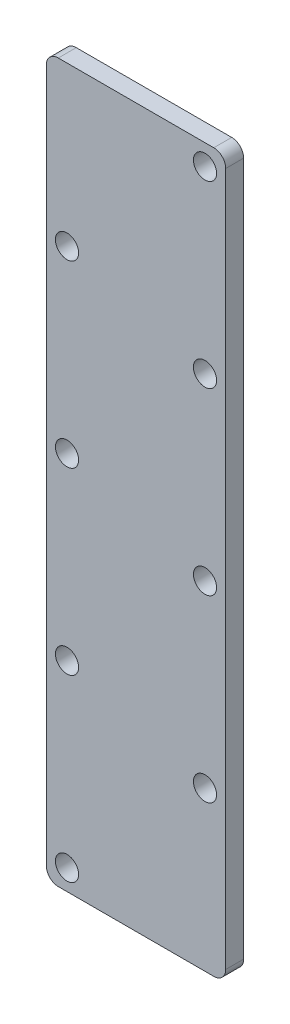
ISO-10303-21;
HEADER;
FILE_DESCRIPTION(('STEP AP214'),'2;1');
FILE_NAME('part.step','',(''),(''),'','','');
FILE_SCHEMA(('AUTOMOTIVE_DESIGN { 1 0 10303 214 1 1 1 1 }'));
ENDSEC;
DATA;
#1=APPLICATION_CONTEXT('core data for automotive mechanical design processes');
#2=APPLICATION_PROTOCOL_DEFINITION('international standard','automotive_design',2000,#1);
#3=PRODUCT_CONTEXT('',#1,'mechanical');
#4=PRODUCT('Part','Part','',(#3));
#5=PRODUCT_RELATED_PRODUCT_CATEGORY('part','',(#4));
#6=PRODUCT_DEFINITION_FORMATION('','',#4);
#7=PRODUCT_DEFINITION_CONTEXT('part definition',#1,'design');
#8=PRODUCT_DEFINITION('design','',#6,#7);
#9=PRODUCT_DEFINITION_SHAPE('','',#8);
#10=(LENGTH_UNIT() NAMED_UNIT(*) SI_UNIT(.MILLI.,.METRE.));
#11=(NAMED_UNIT(*) PLANE_ANGLE_UNIT() SI_UNIT($,.RADIAN.));
#12=(NAMED_UNIT(*) SI_UNIT($,.STERADIAN.) SOLID_ANGLE_UNIT());
#13=UNCERTAINTY_MEASURE_WITH_UNIT(LENGTH_MEASURE(1.E-05),#10,'distance_accuracy_value','');
#14=(GEOMETRIC_REPRESENTATION_CONTEXT(3) GLOBAL_UNCERTAINTY_ASSIGNED_CONTEXT((#13)) GLOBAL_UNIT_ASSIGNED_CONTEXT((#10,
#11,#12)) REPRESENTATION_CONTEXT('',''));
#15=CARTESIAN_POINT('',(0.,0.,0.));
#16=DIRECTION('',(0.,0.,1.));
#17=DIRECTION('',(1.,0.,0.));
#18=AXIS2_PLACEMENT_3D('',#15,#16,#17);
#19=CARTESIAN_POINT('',(2.,2.,3.));
#20=DIRECTION('',(0.,0.,-1.));
#21=DIRECTION('',(-1.,0.,0.));
#22=AXIS2_PLACEMENT_3D('',#19,#20,#21);
#23=CYLINDRICAL_SURFACE('',#22,2.);
#24=CARTESIAN_POINT('',(2.,2.,0.));
#25=DIRECTION('',(0.,0.,1.));
#26=DIRECTION('',(-1.,0.,0.));
#27=AXIS2_PLACEMENT_3D('',#24,#25,#26);
#28=CIRCLE('',#27,2.);
#29=CARTESIAN_POINT('',(0.,2.00000000000001,0.));
#30=VERTEX_POINT('',#29);
#31=CARTESIAN_POINT('',(2.00000000000001,0.,0.));
#32=VERTEX_POINT('',#31);
#33=EDGE_CURVE('E136',#30,#32,#28,.T.);
#34=ORIENTED_EDGE('',*,*,#33,.T.);
#35=DIRECTION('',(0.,0.,-1.));
#36=VECTOR('',#35,1.);
#37=CARTESIAN_POINT('',(2.00000000000001,0.,3.));
#38=LINE('',#37,#36);
#39=CARTESIAN_POINT('',(2.00000000000001,0.,3.));
#40=VERTEX_POINT('',#39);
#41=EDGE_CURVE('E11',#40,#32,#38,.T.);
#42=ORIENTED_EDGE('',*,*,#41,.F.);
#43=CARTESIAN_POINT('',(2.,2.,3.));
#44=DIRECTION('',(0.,0.,1.));
#45=DIRECTION('',(-1.,0.,0.));
#46=AXIS2_PLACEMENT_3D('',#43,#44,#45);
#47=CIRCLE('',#46,2.);
#48=CARTESIAN_POINT('',(0.,2.00000000000001,3.));
#49=VERTEX_POINT('',#48);
#50=EDGE_CURVE('E151',#49,#40,#47,.T.);
#51=ORIENTED_EDGE('',*,*,#50,.F.);
#52=DIRECTION('',(0.,0.,-1.));
#53=VECTOR('',#52,1.);
#54=CARTESIAN_POINT('',(0.,2.00000000000001,3.));
#55=LINE('',#54,#53);
#56=EDGE_CURVE('E132',#49,#30,#55,.T.);
#57=ORIENTED_EDGE('',*,*,#56,.T.);
#58=EDGE_LOOP('',(#34,#42,#51,#57));
#59=FACE_BOUND('',#58,.T.);
#60=ADVANCED_FACE('F38',(#59),#23,.T.);
#61=CARTESIAN_POINT('',(2.00000000000001,0.,3.));
#62=DIRECTION('',(0.,1.,0.));
#63=DIRECTION('',(0.,0.,1.));
#64=AXIS2_PLACEMENT_3D('',#61,#62,#63);
#65=PLANE('',#64);
#66=DIRECTION('',(1.,0.,0.));
#67=VECTOR('',#66,1.);
#68=CARTESIAN_POINT('',(2.00000000000001,0.,0.));
#69=LINE('',#68,#67);
#70=CARTESIAN_POINT('',(28.,0.,0.));
#71=VERTEX_POINT('',#70);
#72=EDGE_CURVE('E139',#32,#71,#69,.T.);
#73=ORIENTED_EDGE('',*,*,#72,.T.);
#74=DIRECTION('',(0.,0.,-1.));
#75=VECTOR('',#74,1.);
#76=CARTESIAN_POINT('',(28.,0.,3.));
#77=LINE('',#76,#75);
#78=CARTESIAN_POINT('',(28.,0.,3.));
#79=VERTEX_POINT('',#78);
#80=EDGE_CURVE('E47',#79,#71,#77,.T.);
#81=ORIENTED_EDGE('',*,*,#80,.F.);
#82=DIRECTION('',(1.,0.,0.));
#83=VECTOR('',#82,1.);
#84=CARTESIAN_POINT('',(2.00000000000001,0.,3.));
#85=LINE('',#84,#83);
#86=EDGE_CURVE('E99',#40,#79,#85,.T.);
#87=ORIENTED_EDGE('',*,*,#86,.F.);
#88=ORIENTED_EDGE('',*,*,#41,.T.);
#89=EDGE_LOOP('',(#73,#81,#87,#88));
#90=FACE_BOUND('',#89,.T.);
#91=ADVANCED_FACE('F236',(#90),#65,.F.);
#92=CARTESIAN_POINT('',(28.,2.,3.));
#93=DIRECTION('',(0.,0.,-1.));
#94=DIRECTION('',(-1.,0.,0.));
#95=AXIS2_PLACEMENT_3D('',#92,#93,#94);
#96=CYLINDRICAL_SURFACE('',#95,2.);
#97=CARTESIAN_POINT('',(28.,2.,0.));
#98=DIRECTION('',(0.,0.,1.));
#99=DIRECTION('',(1.,0.,0.));
#100=AXIS2_PLACEMENT_3D('',#97,#98,#99);
#101=CIRCLE('',#100,2.);
#102=CARTESIAN_POINT('',(30.,2.,0.));
#103=VERTEX_POINT('',#102);
#104=EDGE_CURVE('E142',#71,#103,#101,.T.);
#105=ORIENTED_EDGE('',*,*,#104,.T.);
#106=DIRECTION('',(0.,0.,-1.));
#107=VECTOR('',#106,1.);
#108=CARTESIAN_POINT('',(30.,2.,3.));
#109=LINE('',#108,#107);
#110=CARTESIAN_POINT('',(30.,2.,3.));
#111=VERTEX_POINT('',#110);
#112=EDGE_CURVE('E158',#111,#103,#109,.T.);
#113=ORIENTED_EDGE('',*,*,#112,.F.);
#114=CARTESIAN_POINT('',(28.,2.,3.));
#115=DIRECTION('',(0.,0.,1.));
#116=DIRECTION('',(1.,0.,0.));
#117=AXIS2_PLACEMENT_3D('',#114,#115,#116);
#118=CIRCLE('',#117,2.);
#119=EDGE_CURVE('E204',#79,#111,#118,.T.);
#120=ORIENTED_EDGE('',*,*,#119,.F.);
#121=ORIENTED_EDGE('',*,*,#80,.T.);
#122=EDGE_LOOP('',(#105,#113,#120,#121));
#123=FACE_BOUND('',#122,.T.);
#124=ADVANCED_FACE('F240',(#123),#96,.T.);
#125=CARTESIAN_POINT('',(30.,2.00000000000001,3.));
#126=DIRECTION('',(-1.,0.,0.));
#127=DIRECTION('',(0.,-1.,0.));
#128=AXIS2_PLACEMENT_3D('',#125,#126,#127);
#129=PLANE('',#128);
#130=DIRECTION('',(0.,1.,0.));
#131=VECTOR('',#130,1.);
#132=CARTESIAN_POINT('',(30.,2.00000000000001,0.));
#133=LINE('',#132,#131);
#134=CARTESIAN_POINT('',(30.,118.,0.));
#135=VERTEX_POINT('',#134);
#136=EDGE_CURVE('E144',#103,#135,#133,.T.);
#137=ORIENTED_EDGE('',*,*,#136,.T.);
#138=DIRECTION('',(0.,0.,-1.));
#139=VECTOR('',#138,1.);
#140=CARTESIAN_POINT('',(30.,118.,3.));
#141=LINE('',#140,#139);
#142=CARTESIAN_POINT('',(30.,118.,3.));
#143=VERTEX_POINT('',#142);
#144=EDGE_CURVE('E155',#143,#135,#141,.T.);
#145=ORIENTED_EDGE('',*,*,#144,.F.);
#146=DIRECTION('',(0.,1.,0.));
#147=VECTOR('',#146,1.);
#148=CARTESIAN_POINT('',(30.,2.00000000000001,3.));
#149=LINE('',#148,#147);
#150=EDGE_CURVE('E206',#111,#143,#149,.T.);
#151=ORIENTED_EDGE('',*,*,#150,.F.);
#152=ORIENTED_EDGE('',*,*,#112,.T.);
#153=EDGE_LOOP('',(#137,#145,#151,#152));
#154=FACE_BOUND('',#153,.T.);
#155=ADVANCED_FACE('F212',(#154),#129,.F.);
#156=CARTESIAN_POINT('',(28.,118.,3.));
#157=DIRECTION('',(0.,0.,-1.));
#158=DIRECTION('',(-1.,0.,0.));
#159=AXIS2_PLACEMENT_3D('',#156,#157,#158);
#160=CYLINDRICAL_SURFACE('',#159,2.);
#161=CARTESIAN_POINT('',(28.,118.,0.));
#162=DIRECTION('',(0.,0.,1.));
#163=DIRECTION('',(-1.,0.,0.));
#164=AXIS2_PLACEMENT_3D('',#161,#162,#163);
#165=CIRCLE('',#164,2.);
#166=CARTESIAN_POINT('',(28.,120.,0.));
#167=VERTEX_POINT('',#166);
#168=EDGE_CURVE('E146',#135,#167,#165,.T.);
#169=ORIENTED_EDGE('',*,*,#168,.T.);
#170=DIRECTION('',(0.,0.,-1.));
#171=VECTOR('',#170,1.);
#172=CARTESIAN_POINT('',(28.,120.,3.));
#173=LINE('',#172,#171);
#174=CARTESIAN_POINT('',(28.,120.,3.));
#175=VERTEX_POINT('',#174);
#176=EDGE_CURVE('E127',#175,#167,#173,.T.);
#177=ORIENTED_EDGE('',*,*,#176,.F.);
#178=CARTESIAN_POINT('',(28.,118.,3.));
#179=DIRECTION('',(0.,0.,1.));
#180=DIRECTION('',(-1.,0.,0.));
#181=AXIS2_PLACEMENT_3D('',#178,#179,#180);
#182=CIRCLE('',#181,2.);
#183=EDGE_CURVE('E118',#143,#175,#182,.T.);
#184=ORIENTED_EDGE('',*,*,#183,.F.);
#185=ORIENTED_EDGE('',*,*,#144,.T.);
#186=EDGE_LOOP('',(#169,#177,#184,#185));
#187=FACE_BOUND('',#186,.T.);
#188=ADVANCED_FACE('F216',(#187),#160,.T.);
#189=CARTESIAN_POINT('',(1.99999999999999,120.,3.));
#190=DIRECTION('',(0.,-1.,0.));
#191=DIRECTION('',(0.,0.,-1.));
#192=AXIS2_PLACEMENT_3D('',#189,#190,#191);
#193=PLANE('',#192);
#194=DIRECTION('',(-1.,0.,0.));
#195=VECTOR('',#194,1.);
#196=CARTESIAN_POINT('',(1.99999999999999,120.,0.));
#197=LINE('',#196,#195);
#198=CARTESIAN_POINT('',(1.99999999999999,120.,0.));
#199=VERTEX_POINT('',#198);
#200=EDGE_CURVE('E126',#167,#199,#197,.T.);
#201=ORIENTED_EDGE('',*,*,#200,.T.);
#202=DIRECTION('',(0.,0.,-1.));
#203=VECTOR('',#202,1.);
#204=CARTESIAN_POINT('',(1.99999999999999,120.,3.));
#205=LINE('',#204,#203);
#206=CARTESIAN_POINT('',(1.99999999999999,120.,3.));
#207=VERTEX_POINT('',#206);
#208=EDGE_CURVE('E123',#207,#199,#205,.T.);
#209=ORIENTED_EDGE('',*,*,#208,.F.);
#210=DIRECTION('',(-1.,0.,0.));
#211=VECTOR('',#210,1.);
#212=CARTESIAN_POINT('',(1.99999999999999,120.,3.));
#213=LINE('',#212,#211);
#214=EDGE_CURVE('E112',#175,#207,#213,.T.);
#215=ORIENTED_EDGE('',*,*,#214,.F.);
#216=ORIENTED_EDGE('',*,*,#176,.T.);
#217=EDGE_LOOP('',(#201,#209,#215,#216));
#218=FACE_BOUND('',#217,.T.);
#219=ADVANCED_FACE('F124',(#218),#193,.F.);
#220=CARTESIAN_POINT('',(1.99999999999998,118.,3.));
#221=DIRECTION('',(0.,0.,-1.));
#222=DIRECTION('',(-1.,0.,0.));
#223=AXIS2_PLACEMENT_3D('',#220,#221,#222);
#224=CYLINDRICAL_SURFACE('',#223,2.);
#225=CARTESIAN_POINT('',(1.99999999999998,118.,0.));
#226=DIRECTION('',(0.,0.,1.));
#227=DIRECTION('',(-1.,0.,0.));
#228=AXIS2_PLACEMENT_3D('',#225,#226,#227);
#229=CIRCLE('',#228,2.);
#230=CARTESIAN_POINT('',(0.,118.,0.));
#231=VERTEX_POINT('',#230);
#232=EDGE_CURVE('E85',#199,#231,#229,.T.);
#233=ORIENTED_EDGE('',*,*,#232,.T.);
#234=DIRECTION('',(0.,0.,-1.));
#235=VECTOR('',#234,1.);
#236=CARTESIAN_POINT('',(0.,118.,3.));
#237=LINE('',#236,#235);
#238=CARTESIAN_POINT('',(0.,118.,3.));
#239=VERTEX_POINT('',#238);
#240=EDGE_CURVE('E128',#239,#231,#237,.T.);
#241=ORIENTED_EDGE('',*,*,#240,.F.);
#242=CARTESIAN_POINT('',(1.99999999999998,118.,3.));
#243=DIRECTION('',(0.,0.,1.));
#244=DIRECTION('',(-1.,0.,0.));
#245=AXIS2_PLACEMENT_3D('',#242,#243,#244);
#246=CIRCLE('',#245,2.);
#247=EDGE_CURVE('E116',#207,#239,#246,.T.);
#248=ORIENTED_EDGE('',*,*,#247,.F.);
#249=ORIENTED_EDGE('',*,*,#208,.T.);
#250=EDGE_LOOP('',(#233,#241,#248,#249));
#251=FACE_BOUND('',#250,.T.);
#252=ADVANCED_FACE('F130',(#251),#224,.T.);
#253=CARTESIAN_POINT('',(0.,2.00000000000001,3.));
#254=DIRECTION('',(1.,0.,0.));
#255=DIRECTION('',(0.,1.,0.));
#256=AXIS2_PLACEMENT_3D('',#253,#254,#255);
#257=PLANE('',#256);
#258=DIRECTION('',(0.,-1.,0.));
#259=VECTOR('',#258,1.);
#260=CARTESIAN_POINT('',(0.,2.00000000000001,0.));
#261=LINE('',#260,#259);
#262=EDGE_CURVE('E91',#231,#30,#261,.T.);
#263=ORIENTED_EDGE('',*,*,#262,.T.);
#264=ORIENTED_EDGE('',*,*,#56,.F.);
#265=DIRECTION('',(0.,-1.,0.));
#266=VECTOR('',#265,1.);
#267=CARTESIAN_POINT('',(0.,2.00000000000001,3.));
#268=LINE('',#267,#266);
#269=EDGE_CURVE('E56',#239,#49,#268,.T.);
#270=ORIENTED_EDGE('',*,*,#269,.F.);
#271=ORIENTED_EDGE('',*,*,#240,.T.);
#272=EDGE_LOOP('',(#263,#264,#270,#271));
#273=FACE_BOUND('',#272,.T.);
#274=ADVANCED_FACE('F224',(#273),#257,.F.);
#275=CARTESIAN_POINT('',(2.,2.,3.));
#276=DIRECTION('',(0.,0.,-1.));
#277=DIRECTION('',(-1.,0.,0.));
#278=AXIS2_PLACEMENT_3D('',#275,#276,#277);
#279=PLANE('',#278);
#280=CARTESIAN_POINT('',(3.46069717865196,3.46069717865195,3.));
#281=DIRECTION('',(0.,0.,-1.));
#282=DIRECTION('',(-1.,0.,0.));
#283=AXIS2_PLACEMENT_3D('',#280,#281,#282);
#284=CIRCLE('',#283,1.938);
#285=CARTESIAN_POINT('',(1.52269717865196,3.46069717865195,3.));
#286=VERTEX_POINT('',#285);
#287=EDGE_CURVE('E140',#286,#286,#284,.F.);
#288=ORIENTED_EDGE('',*,*,#287,.F.);
#289=EDGE_LOOP('',(#288));
#290=FACE_BOUND('',#289,.T.);
#291=CARTESIAN_POINT('',(26.5351859444498,26.5351859444497,3.));
#292=DIRECTION('',(0.,0.,-1.));
#293=DIRECTION('',(-1.,0.,0.));
#294=AXIS2_PLACEMENT_3D('',#291,#292,#293);
#295=CIRCLE('',#294,1.938);
#296=CARTESIAN_POINT('',(24.5971859444498,26.5351859444497,3.));
#297=VERTEX_POINT('',#296);
#298=EDGE_CURVE('E188',#297,#297,#295,.F.);
#299=ORIENTED_EDGE('',*,*,#298,.F.);
#300=EDGE_LOOP('',(#299));
#301=FACE_BOUND('',#300,.T.);
#302=CARTESIAN_POINT('',(3.46069717865195,33.460697178652,3.));
#303=DIRECTION('',(0.,0.,-1.));
#304=DIRECTION('',(-1.,0.,0.));
#305=AXIS2_PLACEMENT_3D('',#302,#303,#304);
#306=CIRCLE('',#305,1.938);
#307=CARTESIAN_POINT('',(1.52269717865195,33.460697178652,3.));
#308=VERTEX_POINT('',#307);
#309=EDGE_CURVE('E185',#308,#308,#306,.F.);
#310=ORIENTED_EDGE('',*,*,#309,.F.);
#311=EDGE_LOOP('',(#310));
#312=FACE_BOUND('',#311,.T.);
#313=CARTESIAN_POINT('',(26.5351859444497,56.5351859444497,3.));
#314=DIRECTION('',(0.,0.,-1.));
#315=DIRECTION('',(-1.,0.,0.));
#316=AXIS2_PLACEMENT_3D('',#313,#314,#315);
#317=CIRCLE('',#316,1.938);
#318=CARTESIAN_POINT('',(24.5971859444497,56.5351859444497,3.));
#319=VERTEX_POINT('',#318);
#320=EDGE_CURVE('E182',#319,#319,#317,.F.);
#321=ORIENTED_EDGE('',*,*,#320,.F.);
#322=EDGE_LOOP('',(#321));
#323=FACE_BOUND('',#322,.T.);
#324=CARTESIAN_POINT('',(3.46069717865194,63.4606971786519,3.));
#325=DIRECTION('',(0.,0.,-1.));
#326=DIRECTION('',(-1.,0.,0.));
#327=AXIS2_PLACEMENT_3D('',#324,#325,#326);
#328=CIRCLE('',#327,1.938);
#329=CARTESIAN_POINT('',(1.52269717865194,63.4606971786519,3.));
#330=VERTEX_POINT('',#329);
#331=EDGE_CURVE('E178',#330,#330,#328,.F.);
#332=ORIENTED_EDGE('',*,*,#331,.F.);
#333=EDGE_LOOP('',(#332));
#334=FACE_BOUND('',#333,.T.);
#335=CARTESIAN_POINT('',(26.5351859444497,86.5351859444497,3.));
#336=DIRECTION('',(0.,0.,-1.));
#337=DIRECTION('',(-1.,0.,0.));
#338=AXIS2_PLACEMENT_3D('',#335,#336,#337);
#339=CIRCLE('',#338,1.938);
#340=CARTESIAN_POINT('',(24.5971859444497,86.5351859444497,3.));
#341=VERTEX_POINT('',#340);
#342=EDGE_CURVE('E174',#341,#341,#339,.F.);
#343=ORIENTED_EDGE('',*,*,#342,.F.);
#344=EDGE_LOOP('',(#343));
#345=FACE_BOUND('',#344,.T.);
#346=CARTESIAN_POINT('',(3.46069717865193,93.460697178652,3.));
#347=DIRECTION('',(0.,0.,-1.));
#348=DIRECTION('',(-1.,0.,0.));
#349=AXIS2_PLACEMENT_3D('',#346,#347,#348);
#350=CIRCLE('',#349,1.938);
#351=CARTESIAN_POINT('',(1.52269717865193,93.460697178652,3.));
#352=VERTEX_POINT('',#351);
#353=EDGE_CURVE('E170',#352,#352,#350,.F.);
#354=ORIENTED_EDGE('',*,*,#353,.F.);
#355=EDGE_LOOP('',(#354));
#356=FACE_BOUND('',#355,.T.);
#357=CARTESIAN_POINT('',(26.5351859444497,116.53518594445,3.));
#358=DIRECTION('',(0.,0.,-1.));
#359=DIRECTION('',(-1.,0.,0.));
#360=AXIS2_PLACEMENT_3D('',#357,#358,#359);
#361=CIRCLE('',#360,1.938);
#362=CARTESIAN_POINT('',(24.5971859444497,116.53518594445,3.));
#363=VERTEX_POINT('',#362);
#364=EDGE_CURVE('E166',#363,#363,#361,.F.);
#365=ORIENTED_EDGE('',*,*,#364,.F.);
#366=EDGE_LOOP('',(#365));
#367=FACE_BOUND('',#366,.T.);
#368=ORIENTED_EDGE('',*,*,#50,.T.);
#369=ORIENTED_EDGE('',*,*,#86,.T.);
#370=ORIENTED_EDGE('',*,*,#119,.T.);
#371=ORIENTED_EDGE('',*,*,#150,.T.);
#372=ORIENTED_EDGE('',*,*,#183,.T.);
#373=ORIENTED_EDGE('',*,*,#214,.T.);
#374=ORIENTED_EDGE('',*,*,#247,.T.);
#375=ORIENTED_EDGE('',*,*,#269,.T.);
#376=EDGE_LOOP('',(#368,#369,#370,#371,#372,#373,#374,#375));
#377=FACE_BOUND('',#376,.T.);
#378=ADVANCED_FACE('F114',(#290,#301,#312,#323,#334,#345,#356,#367,#377),#279,.F.);
#379=CARTESIAN_POINT('',(2.,2.,0.));
#380=DIRECTION('',(0.,0.,-1.));
#381=DIRECTION('',(-1.,0.,0.));
#382=AXIS2_PLACEMENT_3D('',#379,#380,#381);
#383=PLANE('',#382);
#384=CARTESIAN_POINT('',(3.46069717865196,3.46069717865195,0.));
#385=DIRECTION('',(0.,0.,-1.));
#386=DIRECTION('',(-1.,0.,0.));
#387=AXIS2_PLACEMENT_3D('',#384,#385,#386);
#388=CIRCLE('',#387,1.938);
#389=CARTESIAN_POINT('',(1.52269717865196,3.46069717865195,0.));
#390=VERTEX_POINT('',#389);
#391=EDGE_CURVE('E41',#390,#390,#388,.F.);
#392=ORIENTED_EDGE('',*,*,#391,.T.);
#393=EDGE_LOOP('',(#392));
#394=FACE_BOUND('',#393,.T.);
#395=CARTESIAN_POINT('',(26.5351859444498,26.5351859444497,0.));
#396=DIRECTION('',(0.,0.,-1.));
#397=DIRECTION('',(-1.,0.,0.));
#398=AXIS2_PLACEMENT_3D('',#395,#396,#397);
#399=CIRCLE('',#398,1.938);
#400=CARTESIAN_POINT('',(24.5971859444498,26.5351859444497,0.));
#401=VERTEX_POINT('',#400);
#402=EDGE_CURVE('E186',#401,#401,#399,.F.);
#403=ORIENTED_EDGE('',*,*,#402,.T.);
#404=EDGE_LOOP('',(#403));
#405=FACE_BOUND('',#404,.T.);
#406=CARTESIAN_POINT('',(3.46069717865195,33.460697178652,0.));
#407=DIRECTION('',(0.,0.,-1.));
#408=DIRECTION('',(-1.,0.,0.));
#409=AXIS2_PLACEMENT_3D('',#406,#407,#408);
#410=CIRCLE('',#409,1.938);
#411=CARTESIAN_POINT('',(1.52269717865195,33.460697178652,0.));
#412=VERTEX_POINT('',#411);
#413=EDGE_CURVE('E183',#412,#412,#410,.F.);
#414=ORIENTED_EDGE('',*,*,#413,.T.);
#415=EDGE_LOOP('',(#414));
#416=FACE_BOUND('',#415,.T.);
#417=CARTESIAN_POINT('',(26.5351859444497,56.5351859444497,0.));
#418=DIRECTION('',(0.,0.,-1.));
#419=DIRECTION('',(-1.,0.,0.));
#420=AXIS2_PLACEMENT_3D('',#417,#418,#419);
#421=CIRCLE('',#420,1.938);
#422=CARTESIAN_POINT('',(24.5971859444497,56.5351859444497,0.));
#423=VERTEX_POINT('',#422);
#424=EDGE_CURVE('E179',#423,#423,#421,.F.);
#425=ORIENTED_EDGE('',*,*,#424,.T.);
#426=EDGE_LOOP('',(#425));
#427=FACE_BOUND('',#426,.T.);
#428=CARTESIAN_POINT('',(3.46069717865194,63.4606971786519,0.));
#429=DIRECTION('',(0.,0.,-1.));
#430=DIRECTION('',(-1.,0.,0.));
#431=AXIS2_PLACEMENT_3D('',#428,#429,#430);
#432=CIRCLE('',#431,1.938);
#433=CARTESIAN_POINT('',(1.52269717865194,63.4606971786519,0.));
#434=VERTEX_POINT('',#433);
#435=EDGE_CURVE('E175',#434,#434,#432,.F.);
#436=ORIENTED_EDGE('',*,*,#435,.T.);
#437=EDGE_LOOP('',(#436));
#438=FACE_BOUND('',#437,.T.);
#439=CARTESIAN_POINT('',(26.5351859444497,86.5351859444497,0.));
#440=DIRECTION('',(0.,0.,-1.));
#441=DIRECTION('',(-1.,0.,0.));
#442=AXIS2_PLACEMENT_3D('',#439,#440,#441);
#443=CIRCLE('',#442,1.938);
#444=CARTESIAN_POINT('',(24.5971859444497,86.5351859444497,0.));
#445=VERTEX_POINT('',#444);
#446=EDGE_CURVE('E171',#445,#445,#443,.F.);
#447=ORIENTED_EDGE('',*,*,#446,.T.);
#448=EDGE_LOOP('',(#447));
#449=FACE_BOUND('',#448,.T.);
#450=CARTESIAN_POINT('',(3.46069717865193,93.460697178652,0.));
#451=DIRECTION('',(0.,0.,-1.));
#452=DIRECTION('',(-1.,0.,0.));
#453=AXIS2_PLACEMENT_3D('',#450,#451,#452);
#454=CIRCLE('',#453,1.938);
#455=CARTESIAN_POINT('',(1.52269717865193,93.460697178652,0.));
#456=VERTEX_POINT('',#455);
#457=EDGE_CURVE('E167',#456,#456,#454,.F.);
#458=ORIENTED_EDGE('',*,*,#457,.T.);
#459=EDGE_LOOP('',(#458));
#460=FACE_BOUND('',#459,.T.);
#461=CARTESIAN_POINT('',(26.5351859444497,116.53518594445,0.));
#462=DIRECTION('',(0.,0.,-1.));
#463=DIRECTION('',(-1.,0.,0.));
#464=AXIS2_PLACEMENT_3D('',#461,#462,#463);
#465=CIRCLE('',#464,1.938);
#466=CARTESIAN_POINT('',(24.5971859444497,116.53518594445,0.));
#467=VERTEX_POINT('',#466);
#468=EDGE_CURVE('E163',#467,#467,#465,.F.);
#469=ORIENTED_EDGE('',*,*,#468,.T.);
#470=EDGE_LOOP('',(#469));
#471=FACE_BOUND('',#470,.T.);
#472=ORIENTED_EDGE('',*,*,#33,.F.);
#473=ORIENTED_EDGE('',*,*,#262,.F.);
#474=ORIENTED_EDGE('',*,*,#232,.F.);
#475=ORIENTED_EDGE('',*,*,#200,.F.);
#476=ORIENTED_EDGE('',*,*,#168,.F.);
#477=ORIENTED_EDGE('',*,*,#136,.F.);
#478=ORIENTED_EDGE('',*,*,#104,.F.);
#479=ORIENTED_EDGE('',*,*,#72,.F.);
#480=EDGE_LOOP('',(#472,#473,#474,#475,#476,#477,#478,#479));
#481=FACE_BOUND('',#480,.T.);
#482=ADVANCED_FACE('F219',(#394,#405,#416,#427,#438,#449,#460,#471,#481),#383,.T.);
#483=CARTESIAN_POINT('',(26.5351859444497,116.53518594445,33.));
#484=DIRECTION('',(0.,0.,-1.));
#485=DIRECTION('',(-1.,0.,0.));
#486=AXIS2_PLACEMENT_3D('',#483,#484,#485);
#487=CYLINDRICAL_SURFACE('',#486,1.938);
#488=ORIENTED_EDGE('',*,*,#468,.F.);
#489=EDGE_LOOP('',(#488));
#490=FACE_BOUND('',#489,.T.);
#491=ORIENTED_EDGE('',*,*,#364,.T.);
#492=EDGE_LOOP('',(#491));
#493=FACE_BOUND('',#492,.T.);
#494=ADVANCED_FACE('F279',(#490,#493),#487,.F.);
#495=CARTESIAN_POINT('',(3.46069717865193,93.460697178652,33.));
#496=DIRECTION('',(0.,0.,-1.));
#497=DIRECTION('',(-1.,0.,0.));
#498=AXIS2_PLACEMENT_3D('',#495,#496,#497);
#499=CYLINDRICAL_SURFACE('',#498,1.938);
#500=ORIENTED_EDGE('',*,*,#457,.F.);
#501=EDGE_LOOP('',(#500));
#502=FACE_BOUND('',#501,.T.);
#503=ORIENTED_EDGE('',*,*,#353,.T.);
#504=EDGE_LOOP('',(#503));
#505=FACE_BOUND('',#504,.T.);
#506=ADVANCED_FACE('F288',(#502,#505),#499,.F.);
#507=CARTESIAN_POINT('',(26.5351859444497,86.5351859444497,33.));
#508=DIRECTION('',(0.,0.,-1.));
#509=DIRECTION('',(-1.,0.,0.));
#510=AXIS2_PLACEMENT_3D('',#507,#508,#509);
#511=CYLINDRICAL_SURFACE('',#510,1.938);
#512=ORIENTED_EDGE('',*,*,#446,.F.);
#513=EDGE_LOOP('',(#512));
#514=FACE_BOUND('',#513,.T.);
#515=ORIENTED_EDGE('',*,*,#342,.T.);
#516=EDGE_LOOP('',(#515));
#517=FACE_BOUND('',#516,.T.);
#518=ADVANCED_FACE('F298',(#514,#517),#511,.F.);
#519=CARTESIAN_POINT('',(3.46069717865194,63.4606971786519,33.));
#520=DIRECTION('',(0.,0.,-1.));
#521=DIRECTION('',(-1.,0.,0.));
#522=AXIS2_PLACEMENT_3D('',#519,#520,#521);
#523=CYLINDRICAL_SURFACE('',#522,1.938);
#524=ORIENTED_EDGE('',*,*,#435,.F.);
#525=EDGE_LOOP('',(#524));
#526=FACE_BOUND('',#525,.T.);
#527=ORIENTED_EDGE('',*,*,#331,.T.);
#528=EDGE_LOOP('',(#527));
#529=FACE_BOUND('',#528,.T.);
#530=ADVANCED_FACE('F308',(#526,#529),#523,.F.);
#531=CARTESIAN_POINT('',(26.5351859444497,56.5351859444497,33.));
#532=DIRECTION('',(0.,0.,-1.));
#533=DIRECTION('',(-1.,0.,0.));
#534=AXIS2_PLACEMENT_3D('',#531,#532,#533);
#535=CYLINDRICAL_SURFACE('',#534,1.938);
#536=ORIENTED_EDGE('',*,*,#424,.F.);
#537=EDGE_LOOP('',(#536));
#538=FACE_BOUND('',#537,.T.);
#539=ORIENTED_EDGE('',*,*,#320,.T.);
#540=EDGE_LOOP('',(#539));
#541=FACE_BOUND('',#540,.T.);
#542=ADVANCED_FACE('F318',(#538,#541),#535,.F.);
#543=CARTESIAN_POINT('',(3.46069717865195,33.460697178652,33.));
#544=DIRECTION('',(0.,0.,-1.));
#545=DIRECTION('',(-0.993935994053913,0.109960173354082,0.));
#546=AXIS2_PLACEMENT_3D('',#543,#544,#545);
#547=CYLINDRICAL_SURFACE('',#546,1.938);
#548=ORIENTED_EDGE('',*,*,#413,.F.);
#549=EDGE_LOOP('',(#548));
#550=FACE_BOUND('',#549,.T.);
#551=ORIENTED_EDGE('',*,*,#309,.T.);
#552=EDGE_LOOP('',(#551));
#553=FACE_BOUND('',#552,.T.);
#554=ADVANCED_FACE('F328',(#550,#553),#547,.F.);
#555=CARTESIAN_POINT('',(26.5351859444498,26.5351859444497,33.));
#556=DIRECTION('',(0.,0.,-1.));
#557=DIRECTION('',(-1.,0.,0.));
#558=AXIS2_PLACEMENT_3D('',#555,#556,#557);
#559=CYLINDRICAL_SURFACE('',#558,1.938);
#560=ORIENTED_EDGE('',*,*,#402,.F.);
#561=EDGE_LOOP('',(#560));
#562=FACE_BOUND('',#561,.T.);
#563=ORIENTED_EDGE('',*,*,#298,.T.);
#564=EDGE_LOOP('',(#563));
#565=FACE_BOUND('',#564,.T.);
#566=ADVANCED_FACE('F338',(#562,#565),#559,.F.);
#567=CARTESIAN_POINT('',(3.46069717865196,3.46069717865195,33.));
#568=DIRECTION('',(0.,0.,-1.));
#569=DIRECTION('',(-1.,0.,0.));
#570=AXIS2_PLACEMENT_3D('',#567,#568,#569);
#571=CYLINDRICAL_SURFACE('',#570,1.938);
#572=ORIENTED_EDGE('',*,*,#391,.F.);
#573=EDGE_LOOP('',(#572));
#574=FACE_BOUND('',#573,.T.);
#575=ORIENTED_EDGE('',*,*,#287,.T.);
#576=EDGE_LOOP('',(#575));
#577=FACE_BOUND('',#576,.T.);
#578=ADVANCED_FACE('F348',(#574,#577),#571,.F.);
#579=CLOSED_SHELL('',(#60,#91,#124,#155,#188,#219,#252,#274,#378,#482,#494,#506,#518,#530,#542,
#554,#566,#578));
#580=MANIFOLD_SOLID_BREP('B2',#579);
#581=ADVANCED_BREP_SHAPE_REPRESENTATION('',(#18,#580),#14);
#582=SHAPE_DEFINITION_REPRESENTATION(#9,#581);
ENDSEC;
END-ISO-10303-21;
